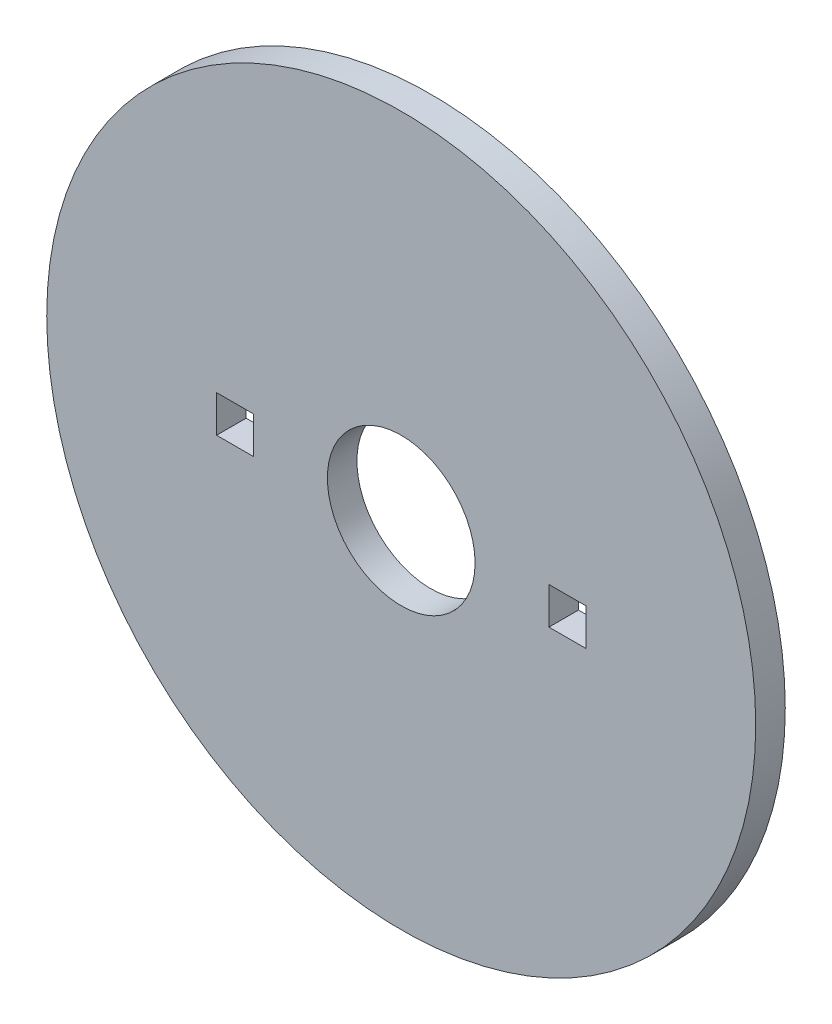
ISO-10303-21;
HEADER;
FILE_DESCRIPTION(('STEP AP214'),'2;1');
FILE_NAME('part.step','',(''),(''),'','','');
FILE_SCHEMA(('AUTOMOTIVE_DESIGN { 1 0 10303 214 1 1 1 1 }'));
ENDSEC;
DATA;
#1=APPLICATION_CONTEXT('core data for automotive mechanical design processes');
#2=APPLICATION_PROTOCOL_DEFINITION('international standard','automotive_design',2000,#1);
#3=PRODUCT_CONTEXT('',#1,'mechanical');
#4=PRODUCT('Part','Part','',(#3));
#5=PRODUCT_RELATED_PRODUCT_CATEGORY('part','',(#4));
#6=PRODUCT_DEFINITION_FORMATION('','',#4);
#7=PRODUCT_DEFINITION_CONTEXT('part definition',#1,'design');
#8=PRODUCT_DEFINITION('design','',#6,#7);
#9=PRODUCT_DEFINITION_SHAPE('','',#8);
#10=(LENGTH_UNIT() NAMED_UNIT(*) SI_UNIT(.MILLI.,.METRE.));
#11=(NAMED_UNIT(*) PLANE_ANGLE_UNIT() SI_UNIT($,.RADIAN.));
#12=(NAMED_UNIT(*) SI_UNIT($,.STERADIAN.) SOLID_ANGLE_UNIT());
#13=UNCERTAINTY_MEASURE_WITH_UNIT(LENGTH_MEASURE(1.E-05),#10,'distance_accuracy_value','');
#14=(GEOMETRIC_REPRESENTATION_CONTEXT(3) GLOBAL_UNCERTAINTY_ASSIGNED_CONTEXT((#13)) GLOBAL_UNIT_ASSIGNED_CONTEXT((#10,
#11,#12)) REPRESENTATION_CONTEXT('',''));
#15=CARTESIAN_POINT('',(0.,0.,0.));
#16=DIRECTION('',(0.,0.,1.));
#17=DIRECTION('',(1.,0.,0.));
#18=AXIS2_PLACEMENT_3D('',#15,#16,#17);
#19=CARTESIAN_POINT('',(0.,0.,0.8));
#20=DIRECTION('',(0.,0.,1.));
#21=DIRECTION('',(1.,0.,0.));
#22=AXIS2_PLACEMENT_3D('',#19,#20,#21);
#23=PLANE('',#22);
#24=CARTESIAN_POINT('',(0.,0.,0.8));
#25=DIRECTION('',(0.,0.,1.));
#26=DIRECTION('',(1.,0.,0.));
#27=AXIS2_PLACEMENT_3D('',#24,#25,#26);
#28=CIRCLE('',#27,2.);
#29=CARTESIAN_POINT('',(2.,0.,0.8));
#30=VERTEX_POINT('',#29);
#31=EDGE_CURVE('E136',#30,#30,#28,.T.);
#32=ORIENTED_EDGE('',*,*,#31,.F.);
#33=EDGE_LOOP('',(#32));
#34=FACE_BOUND('',#33,.T.);
#35=CARTESIAN_POINT('',(0.,0.,0.8));
#36=DIRECTION('',(0.,0.,1.));
#37=DIRECTION('',(1.,0.,0.));
#38=AXIS2_PLACEMENT_3D('',#35,#36,#37);
#39=CIRCLE('',#38,9.6);
#40=CARTESIAN_POINT('',(9.6,0.,0.8));
#41=VERTEX_POINT('',#40);
#42=EDGE_CURVE('E11',#41,#41,#39,.T.);
#43=ORIENTED_EDGE('',*,*,#42,.T.);
#44=EDGE_LOOP('',(#43));
#45=FACE_BOUND('',#44,.T.);
#46=DIRECTION('',(1.,0.,0.));
#47=VECTOR('',#46,1.);
#48=CARTESIAN_POINT('',(0.,0.499999999999999,0.8));
#49=LINE('',#48,#47);
#50=CARTESIAN_POINT('',(4.,0.5,0.8));
#51=VERTEX_POINT('',#50);
#52=CARTESIAN_POINT('',(5.,0.5,0.8));
#53=VERTEX_POINT('',#52);
#54=EDGE_CURVE('E159',#51,#53,#49,.T.);
#55=ORIENTED_EDGE('',*,*,#54,.T.);
#56=DIRECTION('',(0.,-1.,0.));
#57=VECTOR('',#56,1.);
#58=CARTESIAN_POINT('',(5.,0.,0.8));
#59=LINE('',#58,#57);
#60=CARTESIAN_POINT('',(5.,-0.5,0.8));
#61=VERTEX_POINT('',#60);
#62=EDGE_CURVE('E168',#53,#61,#59,.T.);
#63=ORIENTED_EDGE('',*,*,#62,.T.);
#64=DIRECTION('',(-1.,0.,0.));
#65=VECTOR('',#64,1.);
#66=CARTESIAN_POINT('',(0.,-0.499999999999999,0.8));
#67=LINE('',#66,#65);
#68=CARTESIAN_POINT('',(4.,-0.5,0.8));
#69=VERTEX_POINT('',#68);
#70=EDGE_CURVE('E165',#61,#69,#67,.T.);
#71=ORIENTED_EDGE('',*,*,#70,.T.);
#72=DIRECTION('',(0.,1.,0.));
#73=VECTOR('',#72,1.);
#74=CARTESIAN_POINT('',(4.,0.,0.8));
#75=LINE('',#74,#73);
#76=EDGE_CURVE('E162',#69,#51,#75,.T.);
#77=ORIENTED_EDGE('',*,*,#76,.T.);
#78=EDGE_LOOP('',(#55,#63,#71,#77));
#79=FACE_BOUND('',#78,.T.);
#80=DIRECTION('',(-1.,0.,0.));
#81=VECTOR('',#80,1.);
#82=CARTESIAN_POINT('',(0.,-0.499999999999999,0.8));
#83=LINE('',#82,#81);
#84=CARTESIAN_POINT('',(-4.,-0.499999999999972,0.8));
#85=VERTEX_POINT('',#84);
#86=CARTESIAN_POINT('',(-5.,-0.499999999999965,0.8));
#87=VERTEX_POINT('',#86);
#88=EDGE_CURVE('E127',#85,#87,#83,.T.);
#89=ORIENTED_EDGE('',*,*,#88,.T.);
#90=DIRECTION('',(0.,1.,0.));
#91=VECTOR('',#90,1.);
#92=CARTESIAN_POINT('',(-5.,0.,0.8));
#93=LINE('',#92,#91);
#94=CARTESIAN_POINT('',(-5.,0.500000000000035,0.8));
#95=VERTEX_POINT('',#94);
#96=EDGE_CURVE('E134',#87,#95,#93,.T.);
#97=ORIENTED_EDGE('',*,*,#96,.T.);
#98=DIRECTION('',(1.,0.,0.));
#99=VECTOR('',#98,1.);
#100=CARTESIAN_POINT('',(0.,0.499999999999999,0.8));
#101=LINE('',#100,#99);
#102=CARTESIAN_POINT('',(-4.,0.500000000000028,0.8));
#103=VERTEX_POINT('',#102);
#104=EDGE_CURVE('E111',#95,#103,#101,.T.);
#105=ORIENTED_EDGE('',*,*,#104,.T.);
#106=DIRECTION('',(0.,-1.,0.));
#107=VECTOR('',#106,1.);
#108=CARTESIAN_POINT('',(-4.,0.,0.8));
#109=LINE('',#108,#107);
#110=EDGE_CURVE('E130',#103,#85,#109,.T.);
#111=ORIENTED_EDGE('',*,*,#110,.T.);
#112=EDGE_LOOP('',(#89,#97,#105,#111));
#113=FACE_BOUND('',#112,.T.);
#114=ADVANCED_FACE('F32',(#34,#45,#79,#113),#23,.T.);
#115=CARTESIAN_POINT('',(0.,0.,0.));
#116=DIRECTION('',(0.,0.,1.));
#117=DIRECTION('',(1.,0.,0.));
#118=AXIS2_PLACEMENT_3D('',#115,#116,#117);
#119=PLANE('',#118);
#120=CARTESIAN_POINT('',(0.,0.,0.));
#121=DIRECTION('',(0.,0.,1.));
#122=DIRECTION('',(1.,0.,0.));
#123=AXIS2_PLACEMENT_3D('',#120,#121,#122);
#124=CIRCLE('',#123,2.);
#125=CARTESIAN_POINT('',(2.,0.,0.));
#126=VERTEX_POINT('',#125);
#127=EDGE_CURVE('E112',#126,#126,#124,.T.);
#128=ORIENTED_EDGE('',*,*,#127,.T.);
#129=EDGE_LOOP('',(#128));
#130=FACE_BOUND('',#129,.T.);
#131=DIRECTION('',(0.,-1.,0.));
#132=VECTOR('',#131,1.);
#133=CARTESIAN_POINT('',(5.,0.,0.));
#134=LINE('',#133,#132);
#135=CARTESIAN_POINT('',(5.,0.5,0.));
#136=VERTEX_POINT('',#135);
#137=CARTESIAN_POINT('',(5.,-0.5,0.));
#138=VERTEX_POINT('',#137);
#139=EDGE_CURVE('E139',#136,#138,#134,.T.);
#140=ORIENTED_EDGE('',*,*,#139,.F.);
#141=DIRECTION('',(1.,0.,0.));
#142=VECTOR('',#141,1.);
#143=CARTESIAN_POINT('',(0.,0.499999999999999,0.));
#144=LINE('',#143,#142);
#145=CARTESIAN_POINT('',(4.,0.5,0.));
#146=VERTEX_POINT('',#145);
#147=EDGE_CURVE('E146',#146,#136,#144,.T.);
#148=ORIENTED_EDGE('',*,*,#147,.F.);
#149=DIRECTION('',(0.,1.,0.));
#150=VECTOR('',#149,1.);
#151=CARTESIAN_POINT('',(4.,0.,0.));
#152=LINE('',#151,#150);
#153=CARTESIAN_POINT('',(4.,-0.5,0.));
#154=VERTEX_POINT('',#153);
#155=EDGE_CURVE('E143',#154,#146,#152,.T.);
#156=ORIENTED_EDGE('',*,*,#155,.F.);
#157=DIRECTION('',(-1.,0.,0.));
#158=VECTOR('',#157,1.);
#159=CARTESIAN_POINT('',(0.,-0.499999999999999,0.));
#160=LINE('',#159,#158);
#161=EDGE_CURVE('E141',#138,#154,#160,.T.);
#162=ORIENTED_EDGE('',*,*,#161,.F.);
#163=EDGE_LOOP('',(#140,#148,#156,#162));
#164=FACE_BOUND('',#163,.T.);
#165=CARTESIAN_POINT('',(0.,0.,0.));
#166=DIRECTION('',(0.,0.,1.));
#167=DIRECTION('',(1.,0.,0.));
#168=AXIS2_PLACEMENT_3D('',#165,#166,#167);
#169=CIRCLE('',#168,9.6);
#170=CARTESIAN_POINT('',(9.6,0.,0.));
#171=VERTEX_POINT('',#170);
#172=EDGE_CURVE('E36',#171,#171,#169,.T.);
#173=ORIENTED_EDGE('',*,*,#172,.F.);
#174=EDGE_LOOP('',(#173));
#175=FACE_BOUND('',#174,.T.);
#176=DIRECTION('',(0.,1.,0.));
#177=VECTOR('',#176,1.);
#178=CARTESIAN_POINT('',(-5.,0.,0.));
#179=LINE('',#178,#177);
#180=CARTESIAN_POINT('',(-5.,-0.499999999999965,0.));
#181=VERTEX_POINT('',#180);
#182=CARTESIAN_POINT('',(-5.,0.500000000000035,0.));
#183=VERTEX_POINT('',#182);
#184=EDGE_CURVE('E96',#181,#183,#179,.T.);
#185=ORIENTED_EDGE('',*,*,#184,.F.);
#186=DIRECTION('',(-1.,0.,0.));
#187=VECTOR('',#186,1.);
#188=CARTESIAN_POINT('',(0.,-0.499999999999999,0.));
#189=LINE('',#188,#187);
#190=CARTESIAN_POINT('',(-4.,-0.499999999999972,0.));
#191=VERTEX_POINT('',#190);
#192=EDGE_CURVE('E119',#191,#181,#189,.T.);
#193=ORIENTED_EDGE('',*,*,#192,.F.);
#194=DIRECTION('',(0.,-1.,0.));
#195=VECTOR('',#194,1.);
#196=CARTESIAN_POINT('',(-4.,0.,0.));
#197=LINE('',#196,#195);
#198=CARTESIAN_POINT('',(-4.,0.500000000000028,0.));
#199=VERTEX_POINT('',#198);
#200=EDGE_CURVE('E117',#199,#191,#197,.T.);
#201=ORIENTED_EDGE('',*,*,#200,.F.);
#202=DIRECTION('',(1.,0.,0.));
#203=VECTOR('',#202,1.);
#204=CARTESIAN_POINT('',(0.,0.499999999999999,0.));
#205=LINE('',#204,#203);
#206=EDGE_CURVE('E104',#183,#199,#205,.T.);
#207=ORIENTED_EDGE('',*,*,#206,.F.);
#208=EDGE_LOOP('',(#185,#193,#201,#207));
#209=FACE_BOUND('',#208,.T.);
#210=ADVANCED_FACE('F116',(#130,#164,#175,#209),#119,.F.);
#211=CARTESIAN_POINT('',(0.,0.,0.8));
#212=DIRECTION('',(0.,0.,-1.));
#213=DIRECTION('',(-1.,0.,0.));
#214=AXIS2_PLACEMENT_3D('',#211,#212,#213);
#215=CYLINDRICAL_SURFACE('',#214,9.6);
#216=ORIENTED_EDGE('',*,*,#42,.F.);
#217=EDGE_LOOP('',(#216));
#218=FACE_BOUND('',#217,.T.);
#219=ORIENTED_EDGE('',*,*,#172,.T.);
#220=EDGE_LOOP('',(#219));
#221=FACE_BOUND('',#220,.T.);
#222=ADVANCED_FACE('F34',(#218,#221),#215,.T.);
#223=CARTESIAN_POINT('',(5.,0.,0.));
#224=DIRECTION('',(-1.,0.,0.));
#225=DIRECTION('',(0.,0.,1.));
#226=AXIS2_PLACEMENT_3D('',#223,#224,#225);
#227=PLANE('',#226);
#228=DIRECTION('',(0.,0.,1.));
#229=VECTOR('',#228,1.);
#230=CARTESIAN_POINT('',(5.,0.5,0.));
#231=LINE('',#230,#229);
#232=EDGE_CURVE('E148',#136,#53,#231,.T.);
#233=ORIENTED_EDGE('',*,*,#232,.F.);
#234=ORIENTED_EDGE('',*,*,#139,.T.);
#235=DIRECTION('',(0.,0.,1.));
#236=VECTOR('',#235,1.);
#237=CARTESIAN_POINT('',(5.,-0.5,0.));
#238=LINE('',#237,#236);
#239=EDGE_CURVE('E156',#138,#61,#238,.T.);
#240=ORIENTED_EDGE('',*,*,#239,.T.);
#241=ORIENTED_EDGE('',*,*,#62,.F.);
#242=EDGE_LOOP('',(#233,#234,#240,#241));
#243=FACE_BOUND('',#242,.T.);
#244=ADVANCED_FACE('F182',(#243),#227,.T.);
#245=CARTESIAN_POINT('',(0.,-0.499999999999999,0.));
#246=DIRECTION('',(0.,1.,0.));
#247=DIRECTION('',(-1.,0.,0.));
#248=AXIS2_PLACEMENT_3D('',#245,#246,#247);
#249=PLANE('',#248);
#250=ORIENTED_EDGE('',*,*,#239,.F.);
#251=ORIENTED_EDGE('',*,*,#161,.T.);
#252=DIRECTION('',(0.,0.,1.));
#253=VECTOR('',#252,1.);
#254=CARTESIAN_POINT('',(4.,-0.5,0.));
#255=LINE('',#254,#253);
#256=EDGE_CURVE('E153',#154,#69,#255,.T.);
#257=ORIENTED_EDGE('',*,*,#256,.T.);
#258=ORIENTED_EDGE('',*,*,#70,.F.);
#259=EDGE_LOOP('',(#250,#251,#257,#258));
#260=FACE_BOUND('',#259,.T.);
#261=ADVANCED_FACE('F191',(#260),#249,.T.);
#262=CARTESIAN_POINT('',(4.,0.,0.));
#263=DIRECTION('',(1.,0.,0.));
#264=DIRECTION('',(0.,0.,-1.));
#265=AXIS2_PLACEMENT_3D('',#262,#263,#264);
#266=PLANE('',#265);
#267=ORIENTED_EDGE('',*,*,#256,.F.);
#268=ORIENTED_EDGE('',*,*,#155,.T.);
#269=DIRECTION('',(0.,0.,1.));
#270=VECTOR('',#269,1.);
#271=CARTESIAN_POINT('',(4.,0.5,0.));
#272=LINE('',#271,#270);
#273=EDGE_CURVE('E150',#146,#51,#272,.T.);
#274=ORIENTED_EDGE('',*,*,#273,.T.);
#275=ORIENTED_EDGE('',*,*,#76,.F.);
#276=EDGE_LOOP('',(#267,#268,#274,#275));
#277=FACE_BOUND('',#276,.T.);
#278=ADVANCED_FACE('F195',(#277),#266,.T.);
#279=CARTESIAN_POINT('',(0.,0.499999999999999,0.));
#280=DIRECTION('',(0.,-1.,0.));
#281=DIRECTION('',(1.,0.,0.));
#282=AXIS2_PLACEMENT_3D('',#279,#280,#281);
#283=PLANE('',#282);
#284=ORIENTED_EDGE('',*,*,#273,.F.);
#285=ORIENTED_EDGE('',*,*,#147,.T.);
#286=ORIENTED_EDGE('',*,*,#232,.T.);
#287=ORIENTED_EDGE('',*,*,#54,.F.);
#288=EDGE_LOOP('',(#284,#285,#286,#287));
#289=FACE_BOUND('',#288,.T.);
#290=ADVANCED_FACE('F199',(#289),#283,.T.);
#291=CARTESIAN_POINT('',(-5.,0.,0.));
#292=DIRECTION('',(1.,0.,0.));
#293=DIRECTION('',(0.,1.,0.));
#294=AXIS2_PLACEMENT_3D('',#291,#292,#293);
#295=PLANE('',#294);
#296=DIRECTION('',(0.,0.,1.));
#297=VECTOR('',#296,1.);
#298=CARTESIAN_POINT('',(-5.,-0.499999999999965,0.));
#299=LINE('',#298,#297);
#300=EDGE_CURVE('E47',#181,#87,#299,.T.);
#301=ORIENTED_EDGE('',*,*,#300,.F.);
#302=ORIENTED_EDGE('',*,*,#184,.T.);
#303=DIRECTION('',(0.,0.,1.));
#304=VECTOR('',#303,1.);
#305=CARTESIAN_POINT('',(-5.,0.500000000000035,0.));
#306=LINE('',#305,#304);
#307=EDGE_CURVE('E99',#183,#95,#306,.T.);
#308=ORIENTED_EDGE('',*,*,#307,.T.);
#309=ORIENTED_EDGE('',*,*,#96,.F.);
#310=EDGE_LOOP('',(#301,#302,#308,#309));
#311=FACE_BOUND('',#310,.T.);
#312=ADVANCED_FACE('F98',(#311),#295,.T.);
#313=CARTESIAN_POINT('',(0.,0.499999999999999,0.));
#314=DIRECTION('',(0.,-1.,0.));
#315=DIRECTION('',(1.,0.,0.));
#316=AXIS2_PLACEMENT_3D('',#313,#314,#315);
#317=PLANE('',#316);
#318=ORIENTED_EDGE('',*,*,#307,.F.);
#319=ORIENTED_EDGE('',*,*,#206,.T.);
#320=DIRECTION('',(0.,0.,1.));
#321=VECTOR('',#320,1.);
#322=CARTESIAN_POINT('',(-4.,0.500000000000028,0.));
#323=LINE('',#322,#321);
#324=EDGE_CURVE('E113',#199,#103,#323,.T.);
#325=ORIENTED_EDGE('',*,*,#324,.T.);
#326=ORIENTED_EDGE('',*,*,#104,.F.);
#327=EDGE_LOOP('',(#318,#319,#325,#326));
#328=FACE_BOUND('',#327,.T.);
#329=ADVANCED_FACE('F107',(#328),#317,.T.);
#330=CARTESIAN_POINT('',(-4.,0.,0.));
#331=DIRECTION('',(-1.,0.,0.));
#332=DIRECTION('',(0.,-1.,0.));
#333=AXIS2_PLACEMENT_3D('',#330,#331,#332);
#334=PLANE('',#333);
#335=ORIENTED_EDGE('',*,*,#324,.F.);
#336=ORIENTED_EDGE('',*,*,#200,.T.);
#337=DIRECTION('',(0.,0.,1.));
#338=VECTOR('',#337,1.);
#339=CARTESIAN_POINT('',(-4.,-0.499999999999972,0.));
#340=LINE('',#339,#338);
#341=EDGE_CURVE('E52',#191,#85,#340,.T.);
#342=ORIENTED_EDGE('',*,*,#341,.T.);
#343=ORIENTED_EDGE('',*,*,#110,.F.);
#344=EDGE_LOOP('',(#335,#336,#342,#343));
#345=FACE_BOUND('',#344,.T.);
#346=ADVANCED_FACE('F208',(#345),#334,.T.);
#347=CARTESIAN_POINT('',(0.,-0.499999999999999,0.));
#348=DIRECTION('',(0.,1.,0.));
#349=DIRECTION('',(-1.,0.,0.));
#350=AXIS2_PLACEMENT_3D('',#347,#348,#349);
#351=PLANE('',#350);
#352=ORIENTED_EDGE('',*,*,#341,.F.);
#353=ORIENTED_EDGE('',*,*,#192,.T.);
#354=ORIENTED_EDGE('',*,*,#300,.T.);
#355=ORIENTED_EDGE('',*,*,#88,.F.);
#356=EDGE_LOOP('',(#352,#353,#354,#355));
#357=FACE_BOUND('',#356,.T.);
#358=ADVANCED_FACE('F211',(#357),#351,.T.);
#359=CARTESIAN_POINT('',(0.,0.,0.));
#360=DIRECTION('',(0.,0.,1.));
#361=DIRECTION('',(1.,0.,0.));
#362=AXIS2_PLACEMENT_3D('',#359,#360,#361);
#363=CYLINDRICAL_SURFACE('',#362,2.);
#364=ORIENTED_EDGE('',*,*,#31,.T.);
#365=EDGE_LOOP('',(#364));
#366=FACE_BOUND('',#365,.T.);
#367=ORIENTED_EDGE('',*,*,#127,.F.);
#368=EDGE_LOOP('',(#367));
#369=FACE_BOUND('',#368,.T.);
#370=ADVANCED_FACE('F215',(#366,#369),#363,.F.);
#371=CLOSED_SHELL('',(#114,#210,#222,#244,#261,#278,#290,#312,#329,#346,#358,#370));
#372=MANIFOLD_SOLID_BREP('B2',#371);
#373=ADVANCED_BREP_SHAPE_REPRESENTATION('',(#18,#372),#14);
#374=SHAPE_DEFINITION_REPRESENTATION(#9,#373);
ENDSEC;
END-ISO-10303-21;
